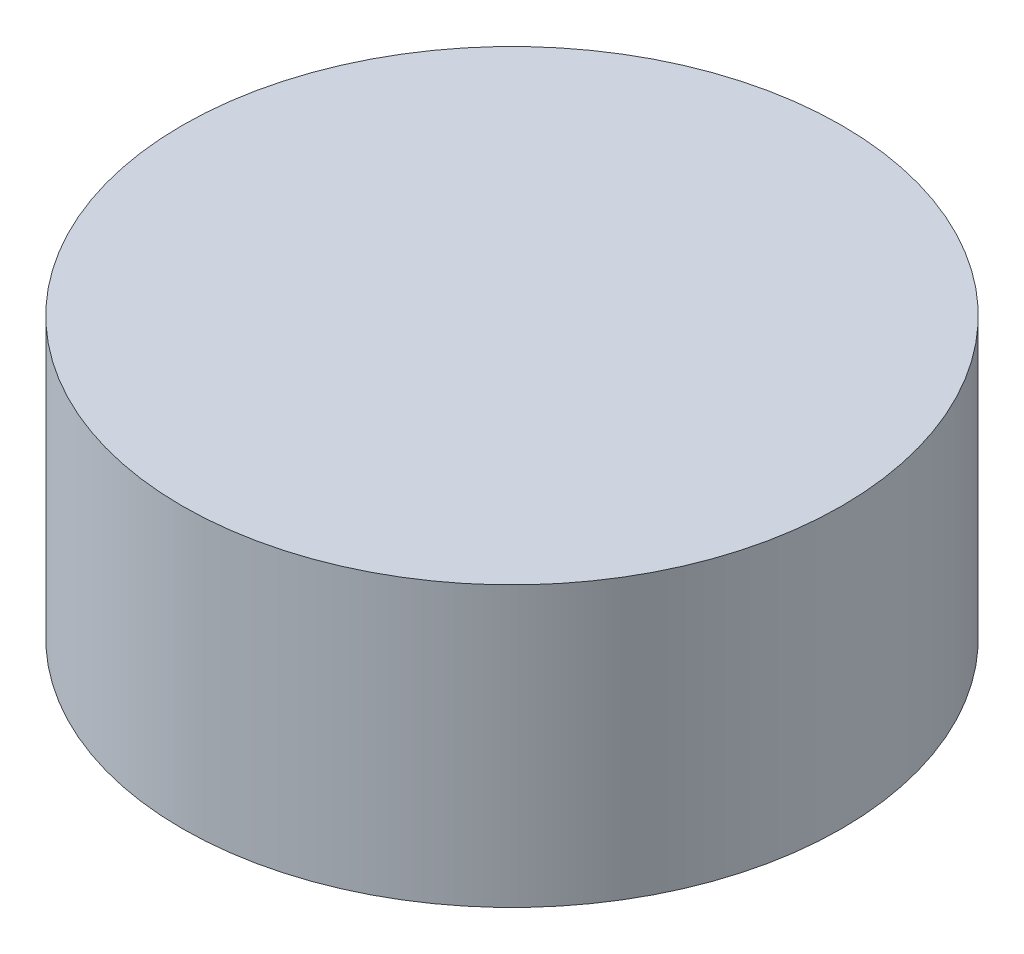
ISO-10303-21;
HEADER;
FILE_DESCRIPTION(('STEP AP214'),'2;1');
FILE_NAME('part.step','',(''),(''),'','','');
FILE_SCHEMA(('AUTOMOTIVE_DESIGN { 1 0 10303 214 1 1 1 1 }'));
ENDSEC;
DATA;
#1=APPLICATION_CONTEXT('core data for automotive mechanical design processes');
#2=APPLICATION_PROTOCOL_DEFINITION('international standard','automotive_design',2000,#1);
#3=PRODUCT_CONTEXT('',#1,'mechanical');
#4=PRODUCT('Part','Part','',(#3));
#5=PRODUCT_RELATED_PRODUCT_CATEGORY('part','',(#4));
#6=PRODUCT_DEFINITION_FORMATION('','',#4);
#7=PRODUCT_DEFINITION_CONTEXT('part definition',#1,'design');
#8=PRODUCT_DEFINITION('design','',#6,#7);
#9=PRODUCT_DEFINITION_SHAPE('','',#8);
#10=(LENGTH_UNIT() NAMED_UNIT(*) SI_UNIT(.MILLI.,.METRE.));
#11=(NAMED_UNIT(*) PLANE_ANGLE_UNIT() SI_UNIT($,.RADIAN.));
#12=(NAMED_UNIT(*) SI_UNIT($,.STERADIAN.) SOLID_ANGLE_UNIT());
#13=UNCERTAINTY_MEASURE_WITH_UNIT(LENGTH_MEASURE(1.E-05),#10,'distance_accuracy_value','');
#14=(GEOMETRIC_REPRESENTATION_CONTEXT(3) GLOBAL_UNCERTAINTY_ASSIGNED_CONTEXT((#13)) GLOBAL_UNIT_ASSIGNED_CONTEXT((#10,
#11,#12)) REPRESENTATION_CONTEXT('',''));
#15=CARTESIAN_POINT('',(0.,0.,0.));
#16=DIRECTION('',(0.,0.,1.));
#17=DIRECTION('',(1.,0.,0.));
#18=AXIS2_PLACEMENT_3D('',#15,#16,#17);
#19=CARTESIAN_POINT('',(0.,12.5,0.));
#20=DIRECTION('',(0.,-1.,0.));
#21=DIRECTION('',(0.,0.,-1.));
#22=AXIS2_PLACEMENT_3D('',#19,#20,#21);
#23=CYLINDRICAL_SURFACE('',#22,29.5);
#24=CARTESIAN_POINT('',(0.,12.5,0.));
#25=DIRECTION('',(0.,1.,0.));
#26=DIRECTION('',(0.,0.,1.));
#27=AXIS2_PLACEMENT_3D('',#24,#25,#26);
#28=CIRCLE('',#27,29.5);
#29=CARTESIAN_POINT('',(0.,12.5,29.5));
#30=VERTEX_POINT('',#29);
#31=EDGE_CURVE('E10',#30,#30,#28,.T.);
#32=ORIENTED_EDGE('',*,*,#31,.F.);
#33=EDGE_LOOP('',(#32));
#34=FACE_BOUND('',#33,.T.);
#35=CARTESIAN_POINT('',(0.,-12.5,0.));
#36=DIRECTION('',(0.,1.,0.));
#37=DIRECTION('',(0.,0.,1.));
#38=AXIS2_PLACEMENT_3D('',#35,#36,#37);
#39=CIRCLE('',#38,29.5);
#40=CARTESIAN_POINT('',(0.,-12.5,29.5));
#41=VERTEX_POINT('',#40);
#42=EDGE_CURVE('E37',#41,#41,#39,.T.);
#43=ORIENTED_EDGE('',*,*,#42,.T.);
#44=EDGE_LOOP('',(#43));
#45=FACE_BOUND('',#44,.T.);
#46=ADVANCED_FACE('F34',(#34,#45),#23,.T.);
#47=CARTESIAN_POINT('',(0.,12.5,0.));
#48=DIRECTION('',(0.,1.,0.));
#49=DIRECTION('',(0.,0.,1.));
#50=AXIS2_PLACEMENT_3D('',#47,#48,#49);
#51=PLANE('',#50);
#52=ORIENTED_EDGE('',*,*,#31,.T.);
#53=EDGE_LOOP('',(#52));
#54=FACE_BOUND('',#53,.T.);
#55=ADVANCED_FACE('F49',(#54),#51,.T.);
#56=CARTESIAN_POINT('',(0.,-12.5,0.));
#57=DIRECTION('',(0.,1.,0.));
#58=DIRECTION('',(0.,0.,1.));
#59=AXIS2_PLACEMENT_3D('',#56,#57,#58);
#60=PLANE('',#59);
#61=ORIENTED_EDGE('',*,*,#42,.F.);
#62=EDGE_LOOP('',(#61));
#63=FACE_BOUND('',#62,.T.);
#64=ADVANCED_FACE('F47',(#63),#60,.F.);
#65=CLOSED_SHELL('',(#46,#55,#64));
#66=MANIFOLD_SOLID_BREP('B2',#65);
#67=ADVANCED_BREP_SHAPE_REPRESENTATION('',(#18,#66),#14);
#68=SHAPE_DEFINITION_REPRESENTATION(#9,#67);
ENDSEC;
END-ISO-10303-21;
